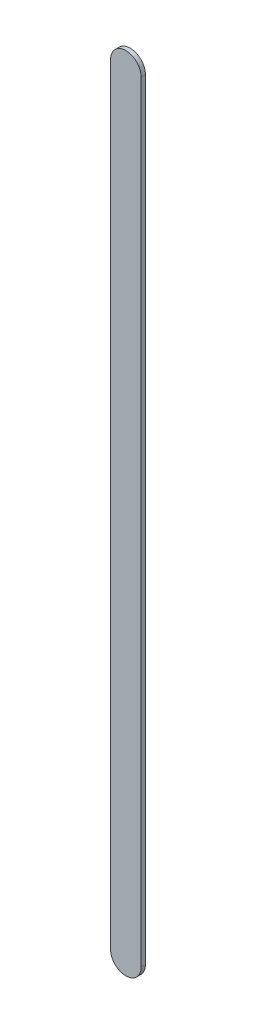
ISO-10303-21;
HEADER;
FILE_DESCRIPTION(('STEP AP214'),'2;1');
FILE_NAME('part.step','',(''),(''),'','','');
FILE_SCHEMA(('AUTOMOTIVE_DESIGN { 1 0 10303 214 1 1 1 1 }'));
ENDSEC;
DATA;
#1=APPLICATION_CONTEXT('core data for automotive mechanical design processes');
#2=APPLICATION_PROTOCOL_DEFINITION('international standard','automotive_design',2000,#1);
#3=PRODUCT_CONTEXT('',#1,'mechanical');
#4=PRODUCT('Part','Part','',(#3));
#5=PRODUCT_RELATED_PRODUCT_CATEGORY('part','',(#4));
#6=PRODUCT_DEFINITION_FORMATION('','',#4);
#7=PRODUCT_DEFINITION_CONTEXT('part definition',#1,'design');
#8=PRODUCT_DEFINITION('design','',#6,#7);
#9=PRODUCT_DEFINITION_SHAPE('','',#8);
#10=(LENGTH_UNIT() NAMED_UNIT(*) SI_UNIT(.MILLI.,.METRE.));
#11=(NAMED_UNIT(*) PLANE_ANGLE_UNIT() SI_UNIT($,.RADIAN.));
#12=(NAMED_UNIT(*) SI_UNIT($,.STERADIAN.) SOLID_ANGLE_UNIT());
#13=UNCERTAINTY_MEASURE_WITH_UNIT(LENGTH_MEASURE(1.E-05),#10,'distance_accuracy_value','');
#14=(GEOMETRIC_REPRESENTATION_CONTEXT(3) GLOBAL_UNCERTAINTY_ASSIGNED_CONTEXT((#13)) GLOBAL_UNIT_ASSIGNED_CONTEXT((#10,
#11,#12)) REPRESENTATION_CONTEXT('',''));
#15=CARTESIAN_POINT('',(0.,0.,0.));
#16=DIRECTION('',(0.,0.,1.));
#17=DIRECTION('',(1.,0.,0.));
#18=AXIS2_PLACEMENT_3D('',#15,#16,#17);
#19=CARTESIAN_POINT('',(93.94397264,84.98706396,0.));
#20=DIRECTION('',(-1.,0.,0.));
#21=DIRECTION('',(0.,1.,0.));
#22=AXIS2_PLACEMENT_3D('',#19,#20,#21);
#23=PLANE('',#22);
#24=DIRECTION('',(0.,1.,0.));
#25=VECTOR('',#24,1.);
#26=CARTESIAN_POINT('',(93.94397264,84.98706396,0.03556));
#27=LINE('',#26,#25);
#28=CARTESIAN_POINT('',(93.94397264,84.98706396,0.03556));
#29=VERTEX_POINT('',#28);
#30=CARTESIAN_POINT('',(93.94397264,91.38697242,0.03556));
#31=VERTEX_POINT('',#30);
#32=EDGE_CURVE('E11',#29,#31,#27,.T.);
#33=ORIENTED_EDGE('',*,*,#32,.F.);
#34=DIRECTION('',(0.,0.,1.));
#35=VECTOR('',#34,1.);
#36=CARTESIAN_POINT('',(93.94397264,84.98706396,0.));
#37=LINE('',#36,#35);
#38=CARTESIAN_POINT('',(93.94397264,84.98706396,0.));
#39=VERTEX_POINT('',#38);
#40=EDGE_CURVE('E24',#39,#29,#37,.T.);
#41=ORIENTED_EDGE('',*,*,#40,.F.);
#42=DIRECTION('',(0.,1.,0.));
#43=VECTOR('',#42,1.);
#44=CARTESIAN_POINT('',(93.94397264,84.98706396,0.));
#45=LINE('',#44,#43);
#46=CARTESIAN_POINT('',(93.94397264,91.38697242,0.));
#47=VERTEX_POINT('',#46);
#48=EDGE_CURVE('E75',#39,#47,#45,.T.);
#49=ORIENTED_EDGE('',*,*,#48,.T.);
#50=DIRECTION('',(0.,0.,1.));
#51=VECTOR('',#50,1.);
#52=CARTESIAN_POINT('',(93.94397264,91.38697242,0.));
#53=LINE('',#52,#51);
#54=EDGE_CURVE('E37',#47,#31,#53,.T.);
#55=ORIENTED_EDGE('',*,*,#54,.T.);
#56=EDGE_LOOP('',(#33,#41,#49,#55));
#57=FACE_BOUND('',#56,.T.);
#58=ADVANCED_FACE('F17',(#57),#23,.F.);
#59=CARTESIAN_POINT('',(93.81697264,91.38697242,0.));
#60=DIRECTION('',(0.,0.,-1.));
#61=DIRECTION('',(1.,1.1189649382048E-13,0.));
#62=AXIS2_PLACEMENT_3D('',#59,#60,#61);
#63=CYLINDRICAL_SURFACE('',#62,0.127000000000005);
#64=CARTESIAN_POINT('',(93.81697264,91.38697242,0.03556));
#65=DIRECTION('',(0.,0.,1.));
#66=DIRECTION('',(1.,1.1189649382048E-13,0.));
#67=AXIS2_PLACEMENT_3D('',#64,#65,#66);
#68=CIRCLE('',#67,0.127000000000005);
#69=CARTESIAN_POINT('',(93.68997264,91.38697242,0.03556));
#70=VERTEX_POINT('',#69);
#71=EDGE_CURVE('E83',#31,#70,#68,.T.);
#72=ORIENTED_EDGE('',*,*,#71,.F.);
#73=ORIENTED_EDGE('',*,*,#54,.F.);
#74=CARTESIAN_POINT('',(93.81697264,91.38697242,0.));
#75=DIRECTION('',(0.,0.,1.));
#76=DIRECTION('',(1.,1.1189649382048E-13,0.));
#77=AXIS2_PLACEMENT_3D('',#74,#75,#76);
#78=CIRCLE('',#77,0.127000000000005);
#79=CARTESIAN_POINT('',(93.68997264,91.38697242,0.));
#80=VERTEX_POINT('',#79);
#81=EDGE_CURVE('E81',#47,#80,#78,.T.);
#82=ORIENTED_EDGE('',*,*,#81,.T.);
#83=DIRECTION('',(0.,0.,1.));
#84=VECTOR('',#83,1.);
#85=CARTESIAN_POINT('',(93.68997264,91.38697242,0.));
#86=LINE('',#85,#84);
#87=EDGE_CURVE('E67',#80,#70,#86,.T.);
#88=ORIENTED_EDGE('',*,*,#87,.T.);
#89=EDGE_LOOP('',(#72,#73,#82,#88));
#90=FACE_BOUND('',#89,.T.);
#91=ADVANCED_FACE('F89',(#90),#63,.T.);
#92=CARTESIAN_POINT('',(93.68997264,91.38697242,0.));
#93=DIRECTION('',(1.,0.,0.));
#94=DIRECTION('',(0.,-1.,0.));
#95=AXIS2_PLACEMENT_3D('',#92,#93,#94);
#96=PLANE('',#95);
#97=DIRECTION('',(0.,-1.,0.));
#98=VECTOR('',#97,1.);
#99=CARTESIAN_POINT('',(93.68997264,91.38697242,0.03556));
#100=LINE('',#99,#98);
#101=CARTESIAN_POINT('',(93.68997264,84.98706396,0.03556));
#102=VERTEX_POINT('',#101);
#103=EDGE_CURVE('E71',#70,#102,#100,.T.);
#104=ORIENTED_EDGE('',*,*,#103,.F.);
#105=ORIENTED_EDGE('',*,*,#87,.F.);
#106=DIRECTION('',(0.,-1.,0.));
#107=VECTOR('',#106,1.);
#108=CARTESIAN_POINT('',(93.68997264,91.38697242,0.));
#109=LINE('',#108,#107);
#110=CARTESIAN_POINT('',(93.68997264,84.98706396,0.));
#111=VERTEX_POINT('',#110);
#112=EDGE_CURVE('E63',#80,#111,#109,.T.);
#113=ORIENTED_EDGE('',*,*,#112,.T.);
#114=DIRECTION('',(0.,0.,1.));
#115=VECTOR('',#114,1.);
#116=CARTESIAN_POINT('',(93.68997264,84.98706396,0.));
#117=LINE('',#116,#115);
#118=EDGE_CURVE('E53',#111,#102,#117,.T.);
#119=ORIENTED_EDGE('',*,*,#118,.T.);
#120=EDGE_LOOP('',(#104,#105,#113,#119));
#121=FACE_BOUND('',#120,.T.);
#122=ADVANCED_FACE('F66',(#121),#96,.F.);
#123=CARTESIAN_POINT('',(93.81697264,84.98706396,0.));
#124=DIRECTION('',(0.,0.,-1.));
#125=DIRECTION('',(-1.,0.,0.));
#126=AXIS2_PLACEMENT_3D('',#123,#124,#125);
#127=CYLINDRICAL_SURFACE('',#126,0.127);
#128=CARTESIAN_POINT('',(93.81697264,84.98706396,0.03556));
#129=DIRECTION('',(0.,0.,1.));
#130=DIRECTION('',(-1.,0.,0.));
#131=AXIS2_PLACEMENT_3D('',#128,#129,#130);
#132=CIRCLE('',#131,0.127);
#133=EDGE_CURVE('E59',#102,#29,#132,.T.);
#134=ORIENTED_EDGE('',*,*,#133,.F.);
#135=ORIENTED_EDGE('',*,*,#118,.F.);
#136=CARTESIAN_POINT('',(93.81697264,84.98706396,0.));
#137=DIRECTION('',(0.,0.,1.));
#138=DIRECTION('',(-1.,0.,0.));
#139=AXIS2_PLACEMENT_3D('',#136,#137,#138);
#140=CIRCLE('',#139,0.127);
#141=EDGE_CURVE('E57',#111,#39,#140,.T.);
#142=ORIENTED_EDGE('',*,*,#141,.T.);
#143=ORIENTED_EDGE('',*,*,#40,.T.);
#144=EDGE_LOOP('',(#134,#135,#142,#143));
#145=FACE_BOUND('',#144,.T.);
#146=ADVANCED_FACE('F55',(#145),#127,.T.);
#147=CARTESIAN_POINT('',(93.94397264,84.98706396,0.));
#148=DIRECTION('',(0.,0.,-1.));
#149=DIRECTION('',(-1.,0.,0.));
#150=AXIS2_PLACEMENT_3D('',#147,#148,#149);
#151=PLANE('',#150);
#152=ORIENTED_EDGE('',*,*,#141,.F.);
#153=ORIENTED_EDGE('',*,*,#112,.F.);
#154=ORIENTED_EDGE('',*,*,#81,.F.);
#155=ORIENTED_EDGE('',*,*,#48,.F.);
#156=EDGE_LOOP('',(#152,#153,#154,#155));
#157=FACE_BOUND('',#156,.T.);
#158=ADVANCED_FACE('F74',(#157),#151,.T.);
#159=CARTESIAN_POINT('',(93.94397264,84.98706396,0.03556));
#160=DIRECTION('',(0.,0.,-1.));
#161=DIRECTION('',(-1.,0.,0.));
#162=AXIS2_PLACEMENT_3D('',#159,#160,#161);
#163=PLANE('',#162);
#164=ORIENTED_EDGE('',*,*,#32,.T.);
#165=ORIENTED_EDGE('',*,*,#71,.T.);
#166=ORIENTED_EDGE('',*,*,#103,.T.);
#167=ORIENTED_EDGE('',*,*,#133,.T.);
#168=EDGE_LOOP('',(#164,#165,#166,#167));
#169=FACE_BOUND('',#168,.T.);
#170=ADVANCED_FACE('F91',(#169),#163,.F.);
#171=CLOSED_SHELL('',(#58,#91,#122,#146,#158,#170));
#172=MANIFOLD_SOLID_BREP('B1',#171);
#173=ADVANCED_BREP_SHAPE_REPRESENTATION('',(#18,#172),#14);
#174=SHAPE_DEFINITION_REPRESENTATION(#9,#173);
ENDSEC;
END-ISO-10303-21;
